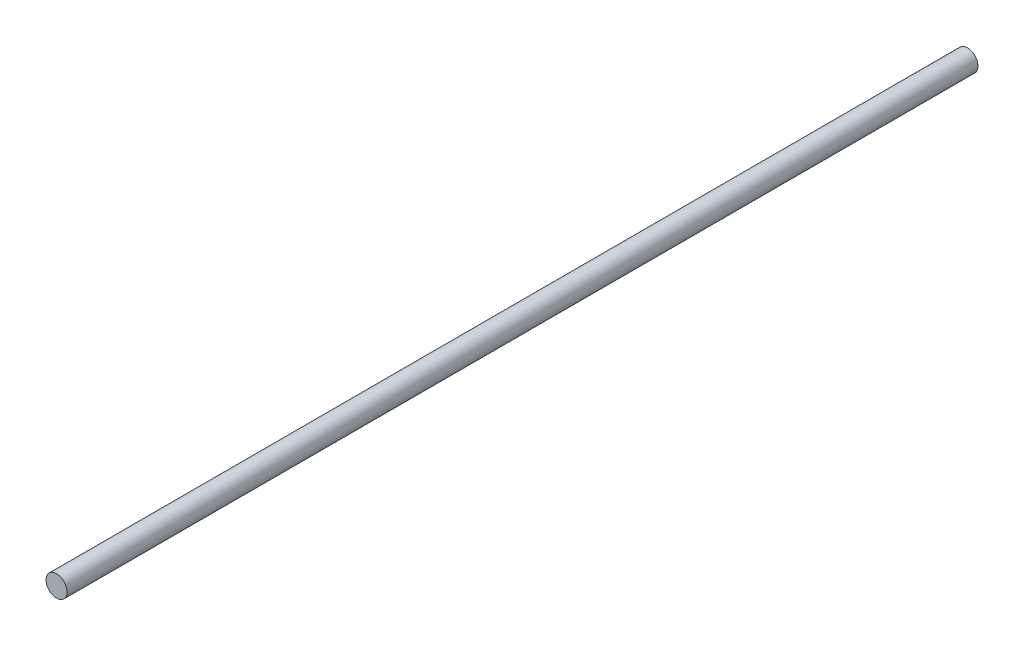
ISO-10303-21;
HEADER;
FILE_DESCRIPTION(('STEP AP214'),'2;1');
FILE_NAME('part.step','',(''),(''),'','','');
FILE_SCHEMA(('AUTOMOTIVE_DESIGN { 1 0 10303 214 1 1 1 1 }'));
ENDSEC;
DATA;
#1=APPLICATION_CONTEXT('core data for automotive mechanical design processes');
#2=APPLICATION_PROTOCOL_DEFINITION('international standard','automotive_design',2000,#1);
#3=PRODUCT_CONTEXT('',#1,'mechanical');
#4=PRODUCT('Part','Part','',(#3));
#5=PRODUCT_RELATED_PRODUCT_CATEGORY('part','',(#4));
#6=PRODUCT_DEFINITION_FORMATION('','',#4);
#7=PRODUCT_DEFINITION_CONTEXT('part definition',#1,'design');
#8=PRODUCT_DEFINITION('design','',#6,#7);
#9=PRODUCT_DEFINITION_SHAPE('','',#8);
#10=(LENGTH_UNIT() NAMED_UNIT(*) SI_UNIT(.MILLI.,.METRE.));
#11=(NAMED_UNIT(*) PLANE_ANGLE_UNIT() SI_UNIT($,.RADIAN.));
#12=(NAMED_UNIT(*) SI_UNIT($,.STERADIAN.) SOLID_ANGLE_UNIT());
#13=UNCERTAINTY_MEASURE_WITH_UNIT(LENGTH_MEASURE(1.E-05),#10,'distance_accuracy_value','');
#14=(GEOMETRIC_REPRESENTATION_CONTEXT(3) GLOBAL_UNCERTAINTY_ASSIGNED_CONTEXT((#13)) GLOBAL_UNIT_ASSIGNED_CONTEXT((#10,
#11,#12)) REPRESENTATION_CONTEXT('',''));
#15=CARTESIAN_POINT('',(0.,0.,0.));
#16=DIRECTION('',(0.,0.,1.));
#17=DIRECTION('',(1.,0.,0.));
#18=AXIS2_PLACEMENT_3D('',#15,#16,#17);
#19=CARTESIAN_POINT('',(0.,0.,250.));
#20=DIRECTION('',(0.,0.,-1.));
#21=DIRECTION('',(-1.,0.,0.));
#22=AXIS2_PLACEMENT_3D('',#19,#20,#21);
#23=CYLINDRICAL_SURFACE('',#22,2.9);
#24=CARTESIAN_POINT('',(0.,0.,250.));
#25=DIRECTION('',(0.,0.,1.));
#26=DIRECTION('',(1.,0.,0.));
#27=AXIS2_PLACEMENT_3D('',#24,#25,#26);
#28=CIRCLE('',#27,2.9);
#29=CARTESIAN_POINT('',(2.9,0.,250.));
#30=VERTEX_POINT('',#29);
#31=EDGE_CURVE('E10',#30,#30,#28,.T.);
#32=ORIENTED_EDGE('',*,*,#31,.F.);
#33=EDGE_LOOP('',(#32));
#34=FACE_BOUND('',#33,.T.);
#35=CARTESIAN_POINT('',(0.,0.,0.));
#36=DIRECTION('',(0.,0.,1.));
#37=DIRECTION('',(1.,0.,0.));
#38=AXIS2_PLACEMENT_3D('',#35,#36,#37);
#39=CIRCLE('',#38,2.9);
#40=CARTESIAN_POINT('',(2.9,0.,0.));
#41=VERTEX_POINT('',#40);
#42=EDGE_CURVE('E40',#41,#41,#39,.T.);
#43=ORIENTED_EDGE('',*,*,#42,.T.);
#44=EDGE_LOOP('',(#43));
#45=FACE_BOUND('',#44,.T.);
#46=ADVANCED_FACE('F37',(#34,#45),#23,.T.);
#47=CARTESIAN_POINT('',(0.,0.,250.));
#48=DIRECTION('',(0.,0.,1.));
#49=DIRECTION('',(1.,0.,0.));
#50=AXIS2_PLACEMENT_3D('',#47,#48,#49);
#51=PLANE('',#50);
#52=ORIENTED_EDGE('',*,*,#31,.T.);
#53=EDGE_LOOP('',(#52));
#54=FACE_BOUND('',#53,.T.);
#55=ADVANCED_FACE('F54',(#54),#51,.T.);
#56=CARTESIAN_POINT('',(0.,0.,0.));
#57=DIRECTION('',(0.,0.,1.));
#58=DIRECTION('',(1.,0.,0.));
#59=AXIS2_PLACEMENT_3D('',#56,#57,#58);
#60=PLANE('',#59);
#61=ORIENTED_EDGE('',*,*,#42,.F.);
#62=EDGE_LOOP('',(#61));
#63=FACE_BOUND('',#62,.T.);
#64=ADVANCED_FACE('F52',(#63),#60,.F.);
#65=CLOSED_SHELL('',(#46,#55,#64));
#66=MANIFOLD_SOLID_BREP('B2',#65);
#67=ADVANCED_BREP_SHAPE_REPRESENTATION('',(#18,#66),#14);
#68=SHAPE_DEFINITION_REPRESENTATION(#9,#67);
ENDSEC;
END-ISO-10303-21;
